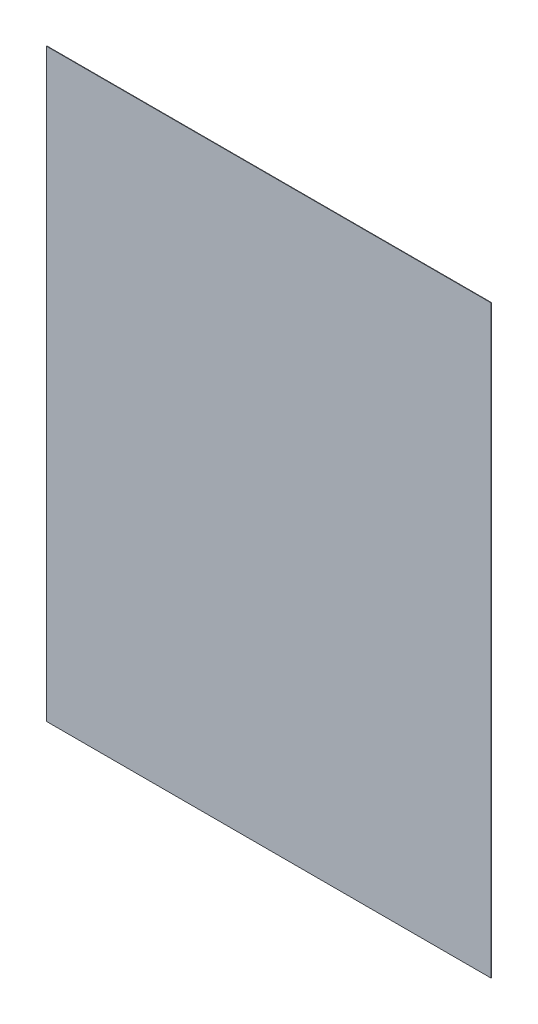
ISO-10303-21;
HEADER;
FILE_DESCRIPTION(('STEP AP214'),'2;1');
FILE_NAME('part.step','',(''),(''),'','','');
FILE_SCHEMA(('AUTOMOTIVE_DESIGN { 1 0 10303 214 1 1 1 1 }'));
ENDSEC;
DATA;
#1=APPLICATION_CONTEXT('core data for automotive mechanical design processes');
#2=APPLICATION_PROTOCOL_DEFINITION('international standard','automotive_design',2000,#1);
#3=PRODUCT_CONTEXT('',#1,'mechanical');
#4=PRODUCT('Part','Part','',(#3));
#5=PRODUCT_RELATED_PRODUCT_CATEGORY('part','',(#4));
#6=PRODUCT_DEFINITION_FORMATION('','',#4);
#7=PRODUCT_DEFINITION_CONTEXT('part definition',#1,'design');
#8=PRODUCT_DEFINITION('design','',#6,#7);
#9=PRODUCT_DEFINITION_SHAPE('','',#8);
#10=(LENGTH_UNIT() NAMED_UNIT(*) SI_UNIT(.MILLI.,.METRE.));
#11=(NAMED_UNIT(*) PLANE_ANGLE_UNIT() SI_UNIT($,.RADIAN.));
#12=(NAMED_UNIT(*) SI_UNIT($,.STERADIAN.) SOLID_ANGLE_UNIT());
#13=UNCERTAINTY_MEASURE_WITH_UNIT(LENGTH_MEASURE(1.E-05),#10,'distance_accuracy_value','');
#14=(GEOMETRIC_REPRESENTATION_CONTEXT(3) GLOBAL_UNCERTAINTY_ASSIGNED_CONTEXT((#13)) GLOBAL_UNIT_ASSIGNED_CONTEXT((#10,
#11,#12)) REPRESENTATION_CONTEXT('',''));
#15=CARTESIAN_POINT('',(0.,0.,0.));
#16=DIRECTION('',(0.,0.,1.));
#17=DIRECTION('',(1.,0.,0.));
#18=AXIS2_PLACEMENT_3D('',#15,#16,#17);
#19=CARTESIAN_POINT('',(78.05,102.75,0.1591));
#20=DIRECTION('',(-1.,0.,0.));
#21=DIRECTION('',(0.,-1.,0.));
#22=AXIS2_PLACEMENT_3D('',#19,#20,#21);
#23=PLANE('',#22);
#24=DIRECTION('',(0.,1.,0.));
#25=VECTOR('',#24,1.);
#26=CARTESIAN_POINT('',(78.05,102.75,0.));
#27=LINE('',#26,#25);
#28=CARTESIAN_POINT('',(78.05,-102.75,0.));
#29=VERTEX_POINT('',#28);
#30=CARTESIAN_POINT('',(78.05,102.75,0.));
#31=VERTEX_POINT('',#30);
#32=EDGE_CURVE('E97',#29,#31,#27,.T.);
#33=ORIENTED_EDGE('',*,*,#32,.T.);
#34=DIRECTION('',(0.,0.,-1.));
#35=VECTOR('',#34,1.);
#36=CARTESIAN_POINT('',(78.05,102.75,0.1591));
#37=LINE('',#36,#35);
#38=CARTESIAN_POINT('',(78.05,102.75,0.1591));
#39=VERTEX_POINT('',#38);
#40=EDGE_CURVE('E11',#39,#31,#37,.T.);
#41=ORIENTED_EDGE('',*,*,#40,.F.);
#42=DIRECTION('',(0.,1.,0.));
#43=VECTOR('',#42,1.);
#44=CARTESIAN_POINT('',(78.05,102.75,0.1591));
#45=LINE('',#44,#43);
#46=CARTESIAN_POINT('',(78.05,-102.75,0.1591));
#47=VERTEX_POINT('',#46);
#48=EDGE_CURVE('E85',#47,#39,#45,.T.);
#49=ORIENTED_EDGE('',*,*,#48,.F.);
#50=DIRECTION('',(0.,0.,-1.));
#51=VECTOR('',#50,1.);
#52=CARTESIAN_POINT('',(78.05,-102.75,0.1591));
#53=LINE('',#52,#51);
#54=EDGE_CURVE('E93',#47,#29,#53,.T.);
#55=ORIENTED_EDGE('',*,*,#54,.T.);
#56=EDGE_LOOP('',(#33,#41,#49,#55));
#57=FACE_BOUND('',#56,.T.);
#58=ADVANCED_FACE('F34',(#57),#23,.F.);
#59=CARTESIAN_POINT('',(-78.05,102.75,0.1591));
#60=DIRECTION('',(0.,-1.,0.));
#61=DIRECTION('',(0.,0.,-1.));
#62=AXIS2_PLACEMENT_3D('',#59,#60,#61);
#63=PLANE('',#62);
#64=DIRECTION('',(-1.,0.,0.));
#65=VECTOR('',#64,1.);
#66=CARTESIAN_POINT('',(-78.05,102.75,0.));
#67=LINE('',#66,#65);
#68=CARTESIAN_POINT('',(-78.05,102.75,0.));
#69=VERTEX_POINT('',#68);
#70=EDGE_CURVE('E89',#31,#69,#67,.T.);
#71=ORIENTED_EDGE('',*,*,#70,.T.);
#72=DIRECTION('',(0.,0.,-1.));
#73=VECTOR('',#72,1.);
#74=CARTESIAN_POINT('',(-78.05,102.75,0.1591));
#75=LINE('',#74,#73);
#76=CARTESIAN_POINT('',(-78.05,102.75,0.1591));
#77=VERTEX_POINT('',#76);
#78=EDGE_CURVE('E42',#77,#69,#75,.T.);
#79=ORIENTED_EDGE('',*,*,#78,.F.);
#80=DIRECTION('',(-1.,0.,0.));
#81=VECTOR('',#80,1.);
#82=CARTESIAN_POINT('',(-78.05,102.75,0.1591));
#83=LINE('',#82,#81);
#84=EDGE_CURVE('E80',#39,#77,#83,.T.);
#85=ORIENTED_EDGE('',*,*,#84,.F.);
#86=ORIENTED_EDGE('',*,*,#40,.T.);
#87=EDGE_LOOP('',(#71,#79,#85,#86));
#88=FACE_BOUND('',#87,.T.);
#89=ADVANCED_FACE('F88',(#88),#63,.F.);
#90=CARTESIAN_POINT('',(-78.05,102.75,0.1591));
#91=DIRECTION('',(1.,0.,0.));
#92=DIRECTION('',(0.,1.,0.));
#93=AXIS2_PLACEMENT_3D('',#90,#91,#92);
#94=PLANE('',#93);
#95=DIRECTION('',(0.,-1.,0.));
#96=VECTOR('',#95,1.);
#97=CARTESIAN_POINT('',(-78.05,102.75,0.));
#98=LINE('',#97,#96);
#99=CARTESIAN_POINT('',(-78.05,-102.75,0.));
#100=VERTEX_POINT('',#99);
#101=EDGE_CURVE('E67',#69,#100,#98,.T.);
#102=ORIENTED_EDGE('',*,*,#101,.T.);
#103=DIRECTION('',(0.,0.,-1.));
#104=VECTOR('',#103,1.);
#105=CARTESIAN_POINT('',(-78.05,-102.75,0.1591));
#106=LINE('',#105,#104);
#107=CARTESIAN_POINT('',(-78.05,-102.75,0.1591));
#108=VERTEX_POINT('',#107);
#109=EDGE_CURVE('E90',#108,#100,#106,.T.);
#110=ORIENTED_EDGE('',*,*,#109,.F.);
#111=DIRECTION('',(0.,-1.,0.));
#112=VECTOR('',#111,1.);
#113=CARTESIAN_POINT('',(-78.05,102.75,0.1591));
#114=LINE('',#113,#112);
#115=EDGE_CURVE('E83',#77,#108,#114,.T.);
#116=ORIENTED_EDGE('',*,*,#115,.F.);
#117=ORIENTED_EDGE('',*,*,#78,.T.);
#118=EDGE_LOOP('',(#102,#110,#116,#117));
#119=FACE_BOUND('',#118,.T.);
#120=ADVANCED_FACE('F91',(#119),#94,.F.);
#121=CARTESIAN_POINT('',(-78.05,-102.75,0.1591));
#122=DIRECTION('',(0.,1.,0.));
#123=DIRECTION('',(0.,0.,1.));
#124=AXIS2_PLACEMENT_3D('',#121,#122,#123);
#125=PLANE('',#124);
#126=DIRECTION('',(1.,0.,0.));
#127=VECTOR('',#126,1.);
#128=CARTESIAN_POINT('',(-78.05,-102.75,0.));
#129=LINE('',#128,#127);
#130=EDGE_CURVE('E73',#100,#29,#129,.T.);
#131=ORIENTED_EDGE('',*,*,#130,.T.);
#132=ORIENTED_EDGE('',*,*,#54,.F.);
#133=DIRECTION('',(1.,0.,0.));
#134=VECTOR('',#133,1.);
#135=CARTESIAN_POINT('',(-78.05,-102.75,0.1591));
#136=LINE('',#135,#134);
#137=EDGE_CURVE('E50',#108,#47,#136,.T.);
#138=ORIENTED_EDGE('',*,*,#137,.F.);
#139=ORIENTED_EDGE('',*,*,#109,.T.);
#140=EDGE_LOOP('',(#131,#132,#138,#139));
#141=FACE_BOUND('',#140,.T.);
#142=ADVANCED_FACE('F104',(#141),#125,.F.);
#143=CARTESIAN_POINT('',(0.,0.,0.1591));
#144=DIRECTION('',(0.,0.,1.));
#145=DIRECTION('',(1.,0.,0.));
#146=AXIS2_PLACEMENT_3D('',#143,#144,#145);
#147=PLANE('',#146);
#148=ORIENTED_EDGE('',*,*,#48,.T.);
#149=ORIENTED_EDGE('',*,*,#84,.T.);
#150=ORIENTED_EDGE('',*,*,#115,.T.);
#151=ORIENTED_EDGE('',*,*,#137,.T.);
#152=EDGE_LOOP('',(#148,#149,#150,#151));
#153=FACE_BOUND('',#152,.T.);
#154=ADVANCED_FACE('F81',(#153),#147,.T.);
#155=CARTESIAN_POINT('',(0.,0.,0.));
#156=DIRECTION('',(0.,0.,1.));
#157=DIRECTION('',(1.,0.,0.));
#158=AXIS2_PLACEMENT_3D('',#155,#156,#157);
#159=PLANE('',#158);
#160=ORIENTED_EDGE('',*,*,#32,.F.);
#161=ORIENTED_EDGE('',*,*,#130,.F.);
#162=ORIENTED_EDGE('',*,*,#101,.F.);
#163=ORIENTED_EDGE('',*,*,#70,.F.);
#164=EDGE_LOOP('',(#160,#161,#162,#163));
#165=FACE_BOUND('',#164,.T.);
#166=ADVANCED_FACE('F107',(#165),#159,.F.);
#167=CLOSED_SHELL('',(#58,#89,#120,#142,#154,#166));
#168=MANIFOLD_SOLID_BREP('B2',#167);
#169=ADVANCED_BREP_SHAPE_REPRESENTATION('',(#18,#168),#14);
#170=SHAPE_DEFINITION_REPRESENTATION(#9,#169);
ENDSEC;
END-ISO-10303-21;
